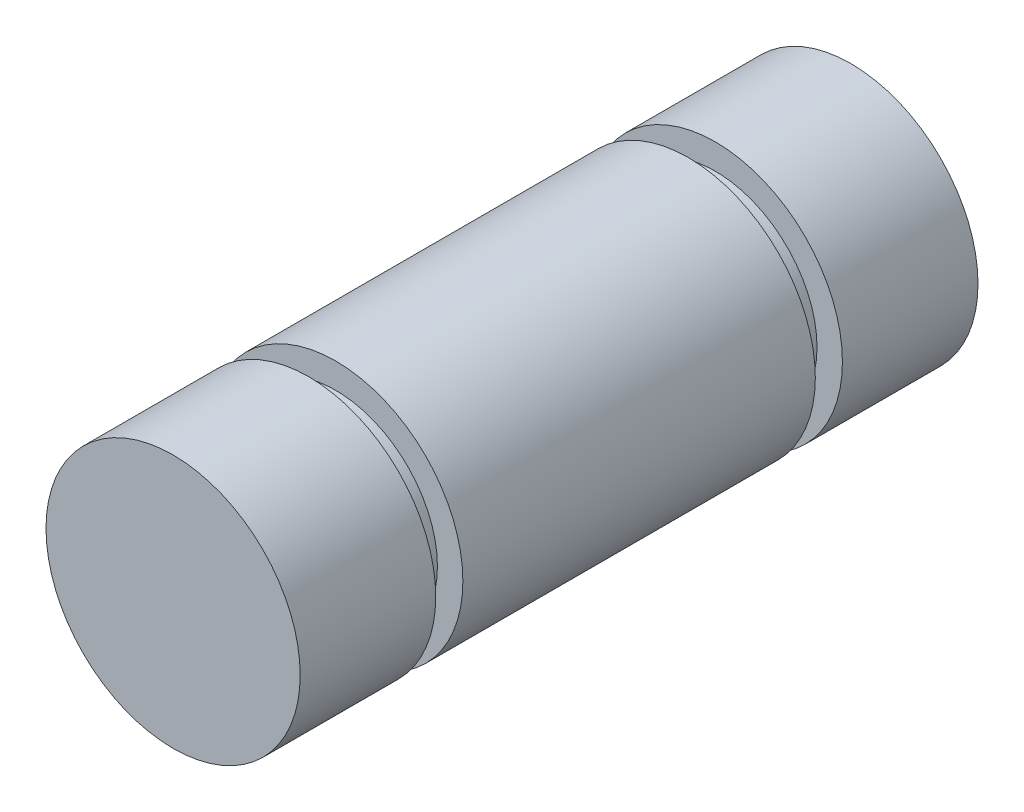
ISO-10303-21;
HEADER;
FILE_DESCRIPTION(('STEP AP214'),'2;1');
FILE_NAME('part.step','',(''),(''),'','','');
FILE_SCHEMA(('AUTOMOTIVE_DESIGN { 1 0 10303 214 1 1 1 1 }'));
ENDSEC;
DATA;
#1=APPLICATION_CONTEXT('core data for automotive mechanical design processes');
#2=APPLICATION_PROTOCOL_DEFINITION('international standard','automotive_design',2000,#1);
#3=PRODUCT_CONTEXT('',#1,'mechanical');
#4=PRODUCT('Part','Part','',(#3));
#5=PRODUCT_RELATED_PRODUCT_CATEGORY('part','',(#4));
#6=PRODUCT_DEFINITION_FORMATION('','',#4);
#7=PRODUCT_DEFINITION_CONTEXT('part definition',#1,'design');
#8=PRODUCT_DEFINITION('design','',#6,#7);
#9=PRODUCT_DEFINITION_SHAPE('','',#8);
#10=(LENGTH_UNIT() NAMED_UNIT(*) SI_UNIT(.MILLI.,.METRE.));
#11=(NAMED_UNIT(*) PLANE_ANGLE_UNIT() SI_UNIT($,.RADIAN.));
#12=(NAMED_UNIT(*) SI_UNIT($,.STERADIAN.) SOLID_ANGLE_UNIT());
#13=UNCERTAINTY_MEASURE_WITH_UNIT(LENGTH_MEASURE(1.E-05),#10,'distance_accuracy_value','');
#14=(GEOMETRIC_REPRESENTATION_CONTEXT(3) GLOBAL_UNCERTAINTY_ASSIGNED_CONTEXT((#13)) GLOBAL_UNIT_ASSIGNED_CONTEXT((#10,
#11,#12)) REPRESENTATION_CONTEXT('',''));
#15=CARTESIAN_POINT('',(0.,0.,0.));
#16=DIRECTION('',(0.,0.,1.));
#17=DIRECTION('',(1.,0.,0.));
#18=AXIS2_PLACEMENT_3D('',#15,#16,#17);
#19=CARTESIAN_POINT('',(0.,0.,12.7));
#20=DIRECTION('',(0.,0.,-1.));
#21=DIRECTION('',(-1.,0.,0.));
#22=AXIS2_PLACEMENT_3D('',#19,#20,#21);
#23=CYLINDRICAL_SURFACE('',#22,4.7625);
#24=CARTESIAN_POINT('',(0.,0.,-7.62));
#25=DIRECTION('',(0.,0.,1.));
#26=DIRECTION('',(1.,0.,0.));
#27=AXIS2_PLACEMENT_3D('',#24,#25,#26);
#28=CIRCLE('',#27,4.7625);
#29=CARTESIAN_POINT('',(4.7625,0.,-7.62));
#30=VERTEX_POINT('',#29);
#31=EDGE_CURVE('E61',#30,#30,#28,.T.);
#32=ORIENTED_EDGE('',*,*,#31,.F.);
#33=EDGE_LOOP('',(#32));
#34=FACE_BOUND('',#33,.T.);
#35=CARTESIAN_POINT('',(0.,0.,-12.7));
#36=DIRECTION('',(0.,0.,1.));
#37=DIRECTION('',(1.,0.,0.));
#38=AXIS2_PLACEMENT_3D('',#35,#36,#37);
#39=CIRCLE('',#38,4.7625);
#40=CARTESIAN_POINT('',(4.7625,0.,-12.7));
#41=VERTEX_POINT('',#40);
#42=EDGE_CURVE('E46',#41,#41,#39,.T.);
#43=ORIENTED_EDGE('',*,*,#42,.T.);
#44=EDGE_LOOP('',(#43));
#45=FACE_BOUND('',#44,.T.);
#46=ADVANCED_FACE('F43',(#34,#45),#23,.T.);
#47=CARTESIAN_POINT('',(0.,0.,-12.7));
#48=DIRECTION('',(0.,0.,1.));
#49=DIRECTION('',(1.,0.,0.));
#50=AXIS2_PLACEMENT_3D('',#47,#48,#49);
#51=PLANE('',#50);
#52=ORIENTED_EDGE('',*,*,#42,.F.);
#53=EDGE_LOOP('',(#52));
#54=FACE_BOUND('',#53,.T.);
#55=ADVANCED_FACE('F93',(#54),#51,.F.);
#56=CARTESIAN_POINT('',(4.7625,0.,-6.604));
#57=DIRECTION('',(0.,0.,1.));
#58=DIRECTION('',(1.,0.,0.));
#59=AXIS2_PLACEMENT_3D('',#56,#57,#58);
#60=PLANE('',#59);
#61=CARTESIAN_POINT('',(0.,0.,-6.604));
#62=DIRECTION('',(0.,0.,1.));
#63=DIRECTION('',(1.,0.,0.));
#64=AXIS2_PLACEMENT_3D('',#61,#62,#63);
#65=CIRCLE('',#64,4.7625);
#66=CARTESIAN_POINT('',(4.7625,0.,-6.604));
#67=VERTEX_POINT('',#66);
#68=EDGE_CURVE('E55',#67,#67,#65,.T.);
#69=ORIENTED_EDGE('',*,*,#68,.F.);
#70=EDGE_LOOP('',(#69));
#71=FACE_BOUND('',#70,.T.);
#72=CARTESIAN_POINT('',(0.,0.,-6.604));
#73=DIRECTION('',(0.,0.,1.));
#74=DIRECTION('',(1.,0.,0.));
#75=AXIS2_PLACEMENT_3D('',#72,#73,#74);
#76=CIRCLE('',#75,3.81);
#77=CARTESIAN_POINT('',(3.81,0.,-6.604));
#78=VERTEX_POINT('',#77);
#79=EDGE_CURVE('E77',#78,#78,#76,.T.);
#80=ORIENTED_EDGE('',*,*,#79,.T.);
#81=EDGE_LOOP('',(#80));
#82=FACE_BOUND('',#81,.T.);
#83=ADVANCED_FACE('F99',(#71,#82),#60,.F.);
#84=CARTESIAN_POINT('',(0.,0.,12.7));
#85=DIRECTION('',(0.,0.,1.));
#86=DIRECTION('',(1.,0.,0.));
#87=AXIS2_PLACEMENT_3D('',#84,#85,#86);
#88=CYLINDRICAL_SURFACE('',#87,3.81);
#89=ORIENTED_EDGE('',*,*,#79,.F.);
#90=EDGE_LOOP('',(#89));
#91=FACE_BOUND('',#90,.T.);
#92=CARTESIAN_POINT('',(0.,0.,-7.62));
#93=DIRECTION('',(0.,0.,1.));
#94=DIRECTION('',(1.,0.,0.));
#95=AXIS2_PLACEMENT_3D('',#92,#93,#94);
#96=CIRCLE('',#95,3.81);
#97=CARTESIAN_POINT('',(3.81,0.,-7.62));
#98=VERTEX_POINT('',#97);
#99=EDGE_CURVE('E81',#98,#98,#96,.T.);
#100=ORIENTED_EDGE('',*,*,#99,.T.);
#101=EDGE_LOOP('',(#100));
#102=FACE_BOUND('',#101,.T.);
#103=ADVANCED_FACE('F104',(#91,#102),#88,.T.);
#104=CARTESIAN_POINT('',(4.7625,0.,-7.62));
#105=DIRECTION('',(0.,0.,-1.));
#106=DIRECTION('',(-1.,0.,0.));
#107=AXIS2_PLACEMENT_3D('',#104,#105,#106);
#108=PLANE('',#107);
#109=ORIENTED_EDGE('',*,*,#99,.F.);
#110=EDGE_LOOP('',(#109));
#111=FACE_BOUND('',#110,.T.);
#112=ORIENTED_EDGE('',*,*,#31,.T.);
#113=EDGE_LOOP('',(#112));
#114=FACE_BOUND('',#113,.T.);
#115=ADVANCED_FACE('F89',(#111,#114),#108,.F.);
#116=ORIENTED_EDGE('',*,*,#68,.T.);
#117=EDGE_LOOP('',(#116));
#118=FACE_BOUND('',#117,.T.);
#119=CARTESIAN_POINT('',(0.,0.,6.604));
#120=DIRECTION('',(0.,0.,1.));
#121=DIRECTION('',(1.,0.,0.));
#122=AXIS2_PLACEMENT_3D('',#119,#120,#121);
#123=CIRCLE('',#122,4.7625);
#124=CARTESIAN_POINT('',(4.7625,0.,6.604));
#125=VERTEX_POINT('',#124);
#126=EDGE_CURVE('E70',#125,#125,#123,.T.);
#127=ORIENTED_EDGE('',*,*,#126,.F.);
#128=EDGE_LOOP('',(#127));
#129=FACE_BOUND('',#128,.T.);
#130=ADVANCED_FACE('F94',(#118,#129),#23,.T.);
#131=CARTESIAN_POINT('',(4.7625,0.,7.62));
#132=DIRECTION('',(0.,0.,1.));
#133=DIRECTION('',(1.,0.,0.));
#134=AXIS2_PLACEMENT_3D('',#131,#132,#133);
#135=PLANE('',#134);
#136=CARTESIAN_POINT('',(0.,0.,7.62));
#137=DIRECTION('',(0.,0.,1.));
#138=DIRECTION('',(1.,0.,0.));
#139=AXIS2_PLACEMENT_3D('',#136,#137,#138);
#140=CIRCLE('',#139,4.7625);
#141=CARTESIAN_POINT('',(4.7625,0.,7.62));
#142=VERTEX_POINT('',#141);
#143=EDGE_CURVE('E57',#142,#142,#140,.T.);
#144=ORIENTED_EDGE('',*,*,#143,.F.);
#145=EDGE_LOOP('',(#144));
#146=FACE_BOUND('',#145,.T.);
#147=CARTESIAN_POINT('',(0.,0.,7.62));
#148=DIRECTION('',(0.,0.,1.));
#149=DIRECTION('',(1.,0.,0.));
#150=AXIS2_PLACEMENT_3D('',#147,#148,#149);
#151=CIRCLE('',#150,3.81);
#152=CARTESIAN_POINT('',(3.81,0.,7.62));
#153=VERTEX_POINT('',#152);
#154=EDGE_CURVE('E62',#153,#153,#151,.T.);
#155=ORIENTED_EDGE('',*,*,#154,.T.);
#156=EDGE_LOOP('',(#155));
#157=FACE_BOUND('',#156,.T.);
#158=ADVANCED_FACE('F111',(#146,#157),#135,.F.);
#159=CARTESIAN_POINT('',(0.,0.,12.7));
#160=DIRECTION('',(0.,0.,1.));
#161=DIRECTION('',(1.,0.,0.));
#162=AXIS2_PLACEMENT_3D('',#159,#160,#161);
#163=CYLINDRICAL_SURFACE('',#162,3.81);
#164=ORIENTED_EDGE('',*,*,#154,.F.);
#165=EDGE_LOOP('',(#164));
#166=FACE_BOUND('',#165,.T.);
#167=CARTESIAN_POINT('',(0.,0.,6.604));
#168=DIRECTION('',(0.,0.,1.));
#169=DIRECTION('',(1.,0.,0.));
#170=AXIS2_PLACEMENT_3D('',#167,#168,#169);
#171=CIRCLE('',#170,3.81);
#172=CARTESIAN_POINT('',(3.81,0.,6.604));
#173=VERTEX_POINT('',#172);
#174=EDGE_CURVE('E66',#173,#173,#171,.T.);
#175=ORIENTED_EDGE('',*,*,#174,.T.);
#176=EDGE_LOOP('',(#175));
#177=FACE_BOUND('',#176,.T.);
#178=ADVANCED_FACE('F114',(#166,#177),#163,.T.);
#179=CARTESIAN_POINT('',(4.7625,0.,6.604));
#180=DIRECTION('',(0.,0.,-1.));
#181=DIRECTION('',(-1.,0.,0.));
#182=AXIS2_PLACEMENT_3D('',#179,#180,#181);
#183=PLANE('',#182);
#184=ORIENTED_EDGE('',*,*,#174,.F.);
#185=EDGE_LOOP('',(#184));
#186=FACE_BOUND('',#185,.T.);
#187=ORIENTED_EDGE('',*,*,#126,.T.);
#188=EDGE_LOOP('',(#187));
#189=FACE_BOUND('',#188,.T.);
#190=ADVANCED_FACE('F110',(#186,#189),#183,.F.);
#191=CARTESIAN_POINT('',(0.,0.,12.7));
#192=DIRECTION('',(0.,0.,1.));
#193=DIRECTION('',(1.,0.,0.));
#194=AXIS2_PLACEMENT_3D('',#191,#192,#193);
#195=PLANE('',#194);
#196=CARTESIAN_POINT('',(0.,0.,12.7));
#197=DIRECTION('',(0.,0.,1.));
#198=DIRECTION('',(1.,0.,0.));
#199=AXIS2_PLACEMENT_3D('',#196,#197,#198);
#200=CIRCLE('',#199,4.7625);
#201=CARTESIAN_POINT('',(4.7625,0.,12.7));
#202=VERTEX_POINT('',#201);
#203=EDGE_CURVE('E10',#202,#202,#200,.T.);
#204=ORIENTED_EDGE('',*,*,#203,.T.);
#205=EDGE_LOOP('',(#204));
#206=FACE_BOUND('',#205,.T.);
#207=ADVANCED_FACE('F108',(#206),#195,.T.);
#208=ORIENTED_EDGE('',*,*,#143,.T.);
#209=EDGE_LOOP('',(#208));
#210=FACE_BOUND('',#209,.T.);
#211=ORIENTED_EDGE('',*,*,#203,.F.);
#212=EDGE_LOOP('',(#211));
#213=FACE_BOUND('',#212,.T.);
#214=ADVANCED_FACE('F95',(#210,#213),#23,.T.);
#215=CLOSED_SHELL('',(#46,#55,#83,#103,#115,#130,#158,#178,#190,#207,#214));
#216=MANIFOLD_SOLID_BREP('B2',#215);
#217=ADVANCED_BREP_SHAPE_REPRESENTATION('',(#18,#216),#14);
#218=SHAPE_DEFINITION_REPRESENTATION(#9,#217);
ENDSEC;
END-ISO-10303-21;
